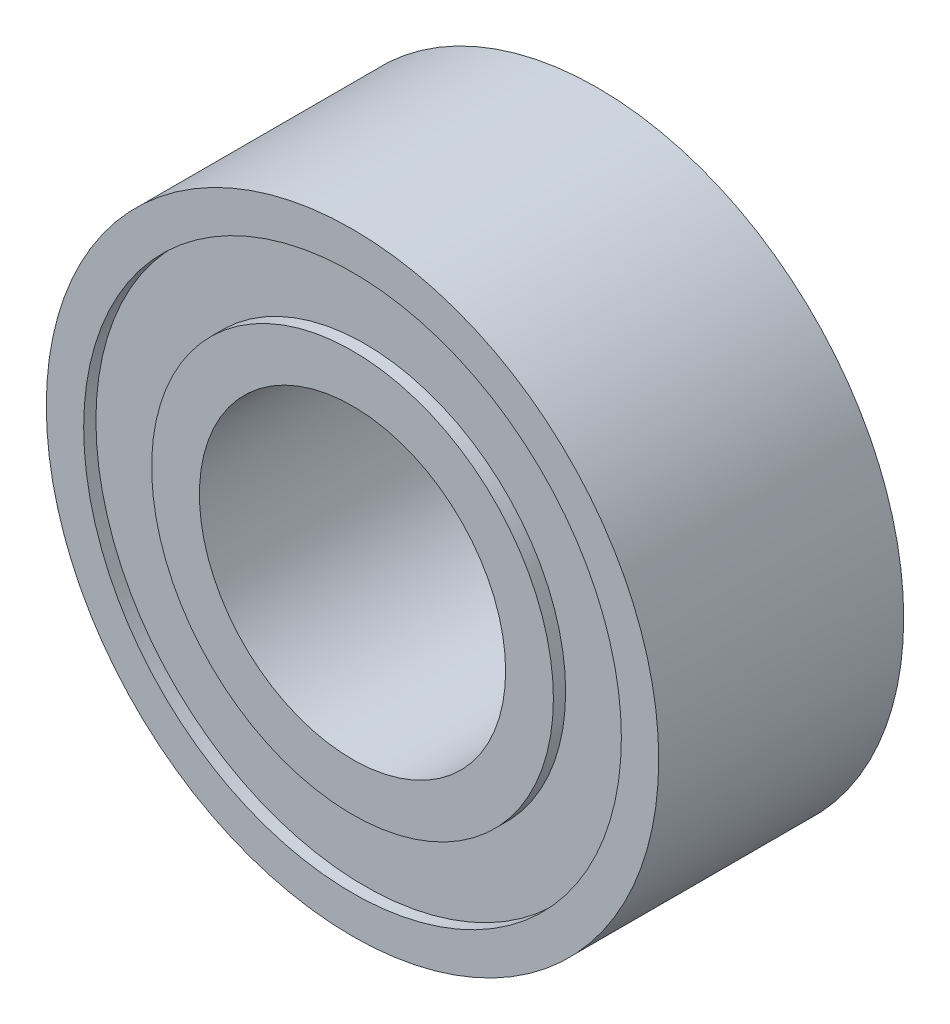
ISO-10303-21;
HEADER;
FILE_DESCRIPTION(('STEP AP214'),'2;1');
FILE_NAME('part.step','',(''),(''),'','','');
FILE_SCHEMA(('AUTOMOTIVE_DESIGN { 1 0 10303 214 1 1 1 1 }'));
ENDSEC;
DATA;
#1=APPLICATION_CONTEXT('core data for automotive mechanical design processes');
#2=APPLICATION_PROTOCOL_DEFINITION('international standard','automotive_design',2000,#1);
#3=PRODUCT_CONTEXT('',#1,'mechanical');
#4=PRODUCT('Part','Part','',(#3));
#5=PRODUCT_RELATED_PRODUCT_CATEGORY('part','',(#4));
#6=PRODUCT_DEFINITION_FORMATION('','',#4);
#7=PRODUCT_DEFINITION_CONTEXT('part definition',#1,'design');
#8=PRODUCT_DEFINITION('design','',#6,#7);
#9=PRODUCT_DEFINITION_SHAPE('','',#8);
#10=(LENGTH_UNIT() NAMED_UNIT(*) SI_UNIT(.MILLI.,.METRE.));
#11=(NAMED_UNIT(*) PLANE_ANGLE_UNIT() SI_UNIT($,.RADIAN.));
#12=(NAMED_UNIT(*) SI_UNIT($,.STERADIAN.) SOLID_ANGLE_UNIT());
#13=UNCERTAINTY_MEASURE_WITH_UNIT(LENGTH_MEASURE(1.E-05),#10,'distance_accuracy_value','');
#14=(GEOMETRIC_REPRESENTATION_CONTEXT(3) GLOBAL_UNCERTAINTY_ASSIGNED_CONTEXT((#13)) GLOBAL_UNIT_ASSIGNED_CONTEXT((#10,
#11,#12)) REPRESENTATION_CONTEXT('',''));
#15=CARTESIAN_POINT('',(0.,0.,0.));
#16=DIRECTION('',(0.,0.,1.));
#17=DIRECTION('',(1.,0.,0.));
#18=AXIS2_PLACEMENT_3D('',#15,#16,#17);
#19=CARTESIAN_POINT('',(0.,0.,-2.));
#20=DIRECTION('',(0.,0.,1.));
#21=DIRECTION('',(1.,0.,0.));
#22=AXIS2_PLACEMENT_3D('',#19,#20,#21);
#23=PLANE('',#22);
#24=CARTESIAN_POINT('',(0.,0.,-2.));
#25=DIRECTION('',(0.,0.,1.));
#26=DIRECTION('',(1.,0.,0.));
#27=AXIS2_PLACEMENT_3D('',#24,#25,#26);
#28=CIRCLE('',#27,2.5);
#29=CARTESIAN_POINT('',(2.5,0.,-2.));
#30=VERTEX_POINT('',#29);
#31=EDGE_CURVE('E45',#30,#30,#28,.T.);
#32=ORIENTED_EDGE('',*,*,#31,.T.);
#33=EDGE_LOOP('',(#32));
#34=FACE_BOUND('',#33,.T.);
#35=CARTESIAN_POINT('',(0.,0.,-2.));
#36=DIRECTION('',(0.,0.,1.));
#37=DIRECTION('',(1.,0.,0.));
#38=AXIS2_PLACEMENT_3D('',#35,#36,#37);
#39=CIRCLE('',#38,3.28);
#40=CARTESIAN_POINT('',(3.28,0.,-2.));
#41=VERTEX_POINT('',#40);
#42=EDGE_CURVE('E69',#41,#41,#39,.T.);
#43=ORIENTED_EDGE('',*,*,#42,.F.);
#44=EDGE_LOOP('',(#43));
#45=FACE_BOUND('',#44,.T.);
#46=ADVANCED_FACE('F32',(#34,#45),#23,.F.);
#47=CARTESIAN_POINT('',(0.,0.,2.));
#48=DIRECTION('',(0.,0.,1.));
#49=DIRECTION('',(1.,0.,0.));
#50=AXIS2_PLACEMENT_3D('',#47,#48,#49);
#51=PLANE('',#50);
#52=CARTESIAN_POINT('',(0.,0.,2.));
#53=DIRECTION('',(0.,0.,1.));
#54=DIRECTION('',(1.,0.,0.));
#55=AXIS2_PLACEMENT_3D('',#52,#53,#54);
#56=CIRCLE('',#55,2.5);
#57=CARTESIAN_POINT('',(2.5,0.,2.));
#58=VERTEX_POINT('',#57);
#59=EDGE_CURVE('E43',#58,#58,#56,.T.);
#60=ORIENTED_EDGE('',*,*,#59,.F.);
#61=EDGE_LOOP('',(#60));
#62=FACE_BOUND('',#61,.T.);
#63=CARTESIAN_POINT('',(0.,0.,2.));
#64=DIRECTION('',(0.,0.,1.));
#65=DIRECTION('',(1.,0.,0.));
#66=AXIS2_PLACEMENT_3D('',#63,#64,#65);
#67=CIRCLE('',#66,3.28);
#68=CARTESIAN_POINT('',(3.28,0.,2.));
#69=VERTEX_POINT('',#68);
#70=EDGE_CURVE('E57',#69,#69,#67,.T.);
#71=ORIENTED_EDGE('',*,*,#70,.T.);
#72=EDGE_LOOP('',(#71));
#73=FACE_BOUND('',#72,.T.);
#74=ADVANCED_FACE('F85',(#62,#73),#51,.T.);
#75=CARTESIAN_POINT('',(0.,0.,2.));
#76=DIRECTION('',(0.,0.,1.));
#77=DIRECTION('',(1.,0.,0.));
#78=AXIS2_PLACEMENT_3D('',#75,#76,#77);
#79=CIRCLE('',#78,4.39);
#80=CARTESIAN_POINT('',(4.39,0.,2.));
#81=VERTEX_POINT('',#80);
#82=EDGE_CURVE('E51',#81,#81,#79,.T.);
#83=ORIENTED_EDGE('',*,*,#82,.F.);
#84=EDGE_LOOP('',(#83));
#85=FACE_BOUND('',#84,.T.);
#86=CARTESIAN_POINT('',(0.,0.,2.));
#87=DIRECTION('',(0.,0.,1.));
#88=DIRECTION('',(1.,0.,0.));
#89=AXIS2_PLACEMENT_3D('',#86,#87,#88);
#90=CIRCLE('',#89,5.);
#91=CARTESIAN_POINT('',(5.,0.,2.));
#92=VERTEX_POINT('',#91);
#93=EDGE_CURVE('E10',#92,#92,#90,.T.);
#94=ORIENTED_EDGE('',*,*,#93,.T.);
#95=EDGE_LOOP('',(#94));
#96=FACE_BOUND('',#95,.T.);
#97=ADVANCED_FACE('F91',(#85,#96),#51,.T.);
#98=CARTESIAN_POINT('',(0.,0.,-2.));
#99=DIRECTION('',(0.,0.,1.));
#100=DIRECTION('',(1.,0.,0.));
#101=AXIS2_PLACEMENT_3D('',#98,#99,#100);
#102=CIRCLE('',#101,4.39);
#103=CARTESIAN_POINT('',(4.39,0.,-2.));
#104=VERTEX_POINT('',#103);
#105=EDGE_CURVE('E63',#104,#104,#102,.T.);
#106=ORIENTED_EDGE('',*,*,#105,.T.);
#107=EDGE_LOOP('',(#106));
#108=FACE_BOUND('',#107,.T.);
#109=CARTESIAN_POINT('',(0.,0.,-2.));
#110=DIRECTION('',(0.,0.,1.));
#111=DIRECTION('',(1.,0.,0.));
#112=AXIS2_PLACEMENT_3D('',#109,#110,#111);
#113=CIRCLE('',#112,5.);
#114=CARTESIAN_POINT('',(5.,0.,-2.));
#115=VERTEX_POINT('',#114);
#116=EDGE_CURVE('E36',#115,#115,#113,.T.);
#117=ORIENTED_EDGE('',*,*,#116,.F.);
#118=EDGE_LOOP('',(#117));
#119=FACE_BOUND('',#118,.T.);
#120=ADVANCED_FACE('F87',(#108,#119),#23,.F.);
#121=CARTESIAN_POINT('',(0.,0.,2.));
#122=DIRECTION('',(0.,0.,-1.));
#123=DIRECTION('',(-1.,0.,0.));
#124=AXIS2_PLACEMENT_3D('',#121,#122,#123);
#125=CYLINDRICAL_SURFACE('',#124,5.);
#126=ORIENTED_EDGE('',*,*,#93,.F.);
#127=EDGE_LOOP('',(#126));
#128=FACE_BOUND('',#127,.T.);
#129=ORIENTED_EDGE('',*,*,#116,.T.);
#130=EDGE_LOOP('',(#129));
#131=FACE_BOUND('',#130,.T.);
#132=ADVANCED_FACE('F34',(#128,#131),#125,.T.);
#133=CARTESIAN_POINT('',(0.,0.,2.));
#134=DIRECTION('',(0.,0.,-1.));
#135=DIRECTION('',(-1.,0.,0.));
#136=AXIS2_PLACEMENT_3D('',#133,#134,#135);
#137=CYLINDRICAL_SURFACE('',#136,2.5);
#138=ORIENTED_EDGE('',*,*,#59,.T.);
#139=EDGE_LOOP('',(#138));
#140=FACE_BOUND('',#139,.T.);
#141=ORIENTED_EDGE('',*,*,#31,.F.);
#142=EDGE_LOOP('',(#141));
#143=FACE_BOUND('',#142,.T.);
#144=ADVANCED_FACE('F100',(#140,#143),#137,.F.);
#145=CARTESIAN_POINT('',(0.,0.,1.8));
#146=DIRECTION('',(0.,0.,1.));
#147=DIRECTION('',(1.,0.,0.));
#148=AXIS2_PLACEMENT_3D('',#145,#146,#147);
#149=CYLINDRICAL_SURFACE('',#148,4.39);
#150=CARTESIAN_POINT('',(0.,0.,1.8));
#151=DIRECTION('',(0.,0.,1.));
#152=DIRECTION('',(1.,0.,0.));
#153=AXIS2_PLACEMENT_3D('',#150,#151,#152);
#154=CIRCLE('',#153,4.39);
#155=CARTESIAN_POINT('',(4.39,0.,1.8));
#156=VERTEX_POINT('',#155);
#157=EDGE_CURVE('E48',#156,#156,#154,.T.);
#158=ORIENTED_EDGE('',*,*,#157,.F.);
#159=EDGE_LOOP('',(#158));
#160=FACE_BOUND('',#159,.T.);
#161=ORIENTED_EDGE('',*,*,#82,.T.);
#162=EDGE_LOOP('',(#161));
#163=FACE_BOUND('',#162,.T.);
#164=ADVANCED_FACE('F124',(#160,#163),#149,.F.);
#165=CARTESIAN_POINT('',(0.,0.,1.8));
#166=DIRECTION('',(0.,0.,1.));
#167=DIRECTION('',(1.,0.,0.));
#168=AXIS2_PLACEMENT_3D('',#165,#166,#167);
#169=PLANE('',#168);
#170=CARTESIAN_POINT('',(0.,0.,1.8));
#171=DIRECTION('',(0.,0.,1.));
#172=DIRECTION('',(1.,0.,0.));
#173=AXIS2_PLACEMENT_3D('',#170,#171,#172);
#174=CIRCLE('',#173,3.28);
#175=CARTESIAN_POINT('',(3.28,0.,1.8));
#176=VERTEX_POINT('',#175);
#177=EDGE_CURVE('E54',#176,#176,#174,.T.);
#178=ORIENTED_EDGE('',*,*,#177,.F.);
#179=EDGE_LOOP('',(#178));
#180=FACE_BOUND('',#179,.T.);
#181=ORIENTED_EDGE('',*,*,#157,.T.);
#182=EDGE_LOOP('',(#181));
#183=FACE_BOUND('',#182,.T.);
#184=ADVANCED_FACE('F120',(#180,#183),#169,.T.);
#185=CARTESIAN_POINT('',(0.,0.,1.8));
#186=DIRECTION('',(0.,0.,1.));
#187=DIRECTION('',(1.,0.,0.));
#188=AXIS2_PLACEMENT_3D('',#185,#186,#187);
#189=CYLINDRICAL_SURFACE('',#188,3.28);
#190=ORIENTED_EDGE('',*,*,#177,.T.);
#191=EDGE_LOOP('',(#190));
#192=FACE_BOUND('',#191,.T.);
#193=ORIENTED_EDGE('',*,*,#70,.F.);
#194=EDGE_LOOP('',(#193));
#195=FACE_BOUND('',#194,.T.);
#196=ADVANCED_FACE('F114',(#192,#195),#189,.T.);
#197=CARTESIAN_POINT('',(0.,0.,-1.8));
#198=DIRECTION('',(0.,0.,-1.));
#199=DIRECTION('',(1.,0.,0.));
#200=AXIS2_PLACEMENT_3D('',#197,#198,#199);
#201=PLANE('',#200);
#202=CARTESIAN_POINT('',(0.,0.,-1.8));
#203=DIRECTION('',(0.,0.,1.));
#204=DIRECTION('',(1.,0.,0.));
#205=AXIS2_PLACEMENT_3D('',#202,#203,#204);
#206=CIRCLE('',#205,4.39);
#207=CARTESIAN_POINT('',(4.39,0.,-1.8));
#208=VERTEX_POINT('',#207);
#209=EDGE_CURVE('E60',#208,#208,#206,.T.);
#210=ORIENTED_EDGE('',*,*,#209,.F.);
#211=EDGE_LOOP('',(#210));
#212=FACE_BOUND('',#211,.T.);
#213=CARTESIAN_POINT('',(0.,0.,-1.8));
#214=DIRECTION('',(0.,0.,1.));
#215=DIRECTION('',(1.,0.,0.));
#216=AXIS2_PLACEMENT_3D('',#213,#214,#215);
#217=CIRCLE('',#216,3.28);
#218=CARTESIAN_POINT('',(3.28,0.,-1.8));
#219=VERTEX_POINT('',#218);
#220=EDGE_CURVE('E66',#219,#219,#217,.T.);
#221=ORIENTED_EDGE('',*,*,#220,.T.);
#222=EDGE_LOOP('',(#221));
#223=FACE_BOUND('',#222,.T.);
#224=ADVANCED_FACE('F75',(#212,#223),#201,.T.);
#225=CARTESIAN_POINT('',(0.,0.,-1.8));
#226=DIRECTION('',(0.,0.,-1.));
#227=DIRECTION('',(-1.,0.,0.));
#228=AXIS2_PLACEMENT_3D('',#225,#226,#227);
#229=CYLINDRICAL_SURFACE('',#228,4.39);
#230=ORIENTED_EDGE('',*,*,#209,.T.);
#231=EDGE_LOOP('',(#230));
#232=FACE_BOUND('',#231,.T.);
#233=ORIENTED_EDGE('',*,*,#105,.F.);
#234=EDGE_LOOP('',(#233));
#235=FACE_BOUND('',#234,.T.);
#236=ADVANCED_FACE('F80',(#232,#235),#229,.F.);
#237=CARTESIAN_POINT('',(0.,0.,-1.8));
#238=DIRECTION('',(0.,0.,-1.));
#239=DIRECTION('',(-1.,0.,0.));
#240=AXIS2_PLACEMENT_3D('',#237,#238,#239);
#241=CYLINDRICAL_SURFACE('',#240,3.28);
#242=ORIENTED_EDGE('',*,*,#220,.F.);
#243=EDGE_LOOP('',(#242));
#244=FACE_BOUND('',#243,.T.);
#245=ORIENTED_EDGE('',*,*,#42,.T.);
#246=EDGE_LOOP('',(#245));
#247=FACE_BOUND('',#246,.T.);
#248=ADVANCED_FACE('F77',(#244,#247),#241,.T.);
#249=CLOSED_SHELL('',(#46,#74,#97,#120,#132,#144,#164,#184,#196,#224,#236,#248));
#250=MANIFOLD_SOLID_BREP('B2',#249);
#251=ADVANCED_BREP_SHAPE_REPRESENTATION('',(#18,#250),#14);
#252=SHAPE_DEFINITION_REPRESENTATION(#9,#251);
ENDSEC;
END-ISO-10303-21;
